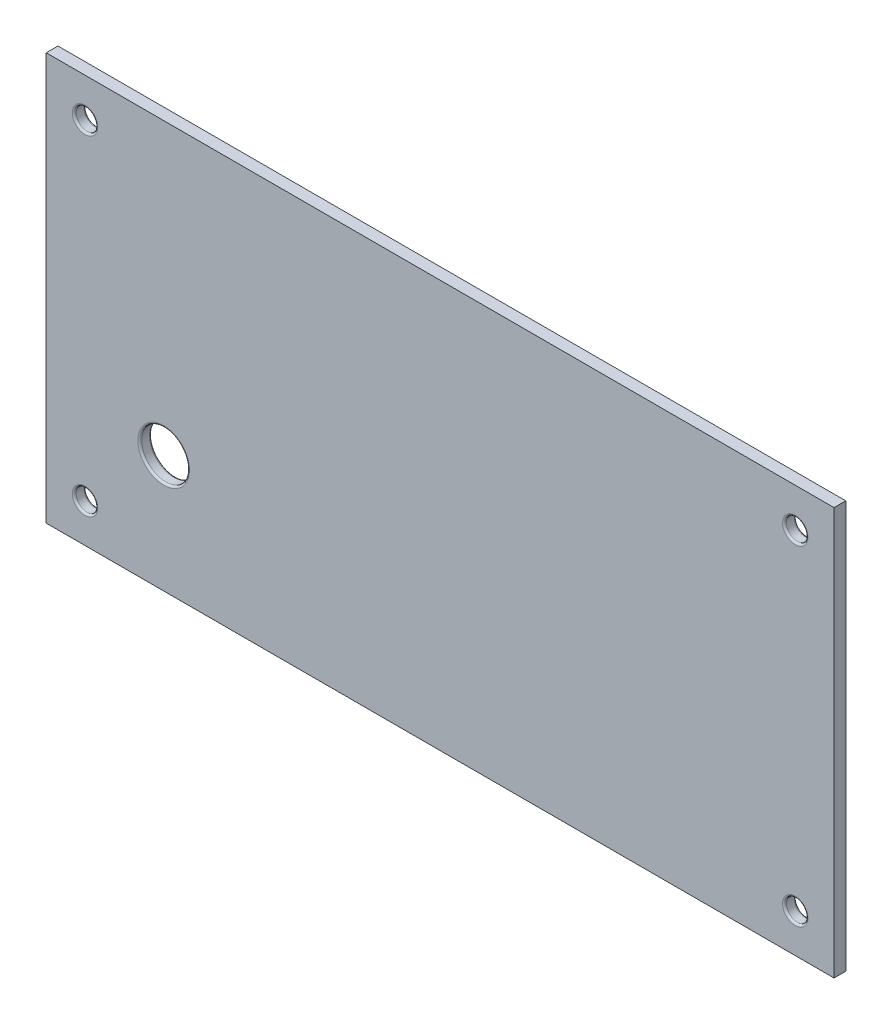
ISO-10303-21;
HEADER;
FILE_DESCRIPTION(('STEP AP214'),'2;1');
FILE_NAME('part.step','',(''),(''),'','','');
FILE_SCHEMA(('AUTOMOTIVE_DESIGN { 1 0 10303 214 1 1 1 1 }'));
ENDSEC;
DATA;
#1=APPLICATION_CONTEXT('core data for automotive mechanical design processes');
#2=APPLICATION_PROTOCOL_DEFINITION('international standard','automotive_design',2000,#1);
#3=PRODUCT_CONTEXT('',#1,'mechanical');
#4=PRODUCT('Part','Part','',(#3));
#5=PRODUCT_RELATED_PRODUCT_CATEGORY('part','',(#4));
#6=PRODUCT_DEFINITION_FORMATION('','',#4);
#7=PRODUCT_DEFINITION_CONTEXT('part definition',#1,'design');
#8=PRODUCT_DEFINITION('design','',#6,#7);
#9=PRODUCT_DEFINITION_SHAPE('','',#8);
#10=(LENGTH_UNIT() NAMED_UNIT(*) SI_UNIT(.MILLI.,.METRE.));
#11=(NAMED_UNIT(*) PLANE_ANGLE_UNIT() SI_UNIT($,.RADIAN.));
#12=(NAMED_UNIT(*) SI_UNIT($,.STERADIAN.) SOLID_ANGLE_UNIT());
#13=UNCERTAINTY_MEASURE_WITH_UNIT(LENGTH_MEASURE(1.E-05),#10,'distance_accuracy_value','');
#14=(GEOMETRIC_REPRESENTATION_CONTEXT(3) GLOBAL_UNCERTAINTY_ASSIGNED_CONTEXT((#13)) GLOBAL_UNIT_ASSIGNED_CONTEXT((#10,
#11,#12)) REPRESENTATION_CONTEXT('',''));
#15=CARTESIAN_POINT('',(0.,0.,0.));
#16=DIRECTION('',(0.,0.,1.));
#17=DIRECTION('',(1.,0.,0.));
#18=AXIS2_PLACEMENT_3D('',#15,#16,#17);
#19=CARTESIAN_POINT('',(100.602,-52.02,3.));
#20=DIRECTION('',(-1.,0.,0.));
#21=DIRECTION('',(0.,0.,1.));
#22=AXIS2_PLACEMENT_3D('',#19,#20,#21);
#23=PLANE('',#22);
#24=DIRECTION('',(0.,1.,0.));
#25=VECTOR('',#24,1.);
#26=CARTESIAN_POINT('',(100.602,-52.02,0.));
#27=LINE('',#26,#25);
#28=CARTESIAN_POINT('',(100.602,-52.02,0.));
#29=VERTEX_POINT('',#28);
#30=CARTESIAN_POINT('',(100.602,52.02,0.));
#31=VERTEX_POINT('',#30);
#32=EDGE_CURVE('E109',#29,#31,#27,.T.);
#33=ORIENTED_EDGE('',*,*,#32,.T.);
#34=DIRECTION('',(0.,0.,-1.));
#35=VECTOR('',#34,1.);
#36=CARTESIAN_POINT('',(100.602,52.02,3.));
#37=LINE('',#36,#35);
#38=CARTESIAN_POINT('',(100.602,52.02,3.));
#39=VERTEX_POINT('',#38);
#40=EDGE_CURVE('E100',#39,#31,#37,.T.);
#41=ORIENTED_EDGE('',*,*,#40,.F.);
#42=DIRECTION('',(0.,1.,0.));
#43=VECTOR('',#42,1.);
#44=CARTESIAN_POINT('',(100.602,-52.02,3.));
#45=LINE('',#44,#43);
#46=CARTESIAN_POINT('',(100.602,-52.02,3.));
#47=VERTEX_POINT('',#46);
#48=EDGE_CURVE('E94',#47,#39,#45,.T.);
#49=ORIENTED_EDGE('',*,*,#48,.F.);
#50=DIRECTION('',(0.,0.,-1.));
#51=VECTOR('',#50,1.);
#52=CARTESIAN_POINT('',(100.602,-52.02,3.));
#53=LINE('',#52,#51);
#54=EDGE_CURVE('E105',#47,#29,#53,.T.);
#55=ORIENTED_EDGE('',*,*,#54,.T.);
#56=EDGE_LOOP('',(#33,#41,#49,#55));
#57=FACE_BOUND('',#56,.T.);
#58=ADVANCED_FACE('F41',(#57),#23,.F.);
#59=CARTESIAN_POINT('',(-100.602,52.02,3.));
#60=DIRECTION('',(0.,-1.,0.));
#61=DIRECTION('',(0.,0.,-1.));
#62=AXIS2_PLACEMENT_3D('',#59,#60,#61);
#63=PLANE('',#62);
#64=DIRECTION('',(-1.,0.,0.));
#65=VECTOR('',#64,1.);
#66=CARTESIAN_POINT('',(-100.602,52.02,0.));
#67=LINE('',#66,#65);
#68=CARTESIAN_POINT('',(-100.602,52.02,0.));
#69=VERTEX_POINT('',#68);
#70=EDGE_CURVE('E99',#31,#69,#67,.T.);
#71=ORIENTED_EDGE('',*,*,#70,.T.);
#72=DIRECTION('',(0.,0.,-1.));
#73=VECTOR('',#72,1.);
#74=CARTESIAN_POINT('',(-100.602,52.02,3.));
#75=LINE('',#74,#73);
#76=CARTESIAN_POINT('',(-100.602,52.02,3.));
#77=VERTEX_POINT('',#76);
#78=EDGE_CURVE('E97',#77,#69,#75,.T.);
#79=ORIENTED_EDGE('',*,*,#78,.F.);
#80=DIRECTION('',(-1.,0.,0.));
#81=VECTOR('',#80,1.);
#82=CARTESIAN_POINT('',(-100.602,52.02,3.));
#83=LINE('',#82,#81);
#84=EDGE_CURVE('E89',#39,#77,#83,.T.);
#85=ORIENTED_EDGE('',*,*,#84,.F.);
#86=ORIENTED_EDGE('',*,*,#40,.T.);
#87=EDGE_LOOP('',(#71,#79,#85,#86));
#88=FACE_BOUND('',#87,.T.);
#89=ADVANCED_FACE('F98',(#88),#63,.F.);
#90=CARTESIAN_POINT('',(-100.602,-52.02,3.));
#91=DIRECTION('',(1.,0.,0.));
#92=DIRECTION('',(0.,0.,-1.));
#93=AXIS2_PLACEMENT_3D('',#90,#91,#92);
#94=PLANE('',#93);
#95=DIRECTION('',(0.,-1.,0.));
#96=VECTOR('',#95,1.);
#97=CARTESIAN_POINT('',(-100.602,-52.02,0.));
#98=LINE('',#97,#96);
#99=CARTESIAN_POINT('',(-100.602,-52.02,0.));
#100=VERTEX_POINT('',#99);
#101=EDGE_CURVE('E75',#69,#100,#98,.T.);
#102=ORIENTED_EDGE('',*,*,#101,.T.);
#103=DIRECTION('',(0.,0.,-1.));
#104=VECTOR('',#103,1.);
#105=CARTESIAN_POINT('',(-100.602,-52.02,3.));
#106=LINE('',#105,#104);
#107=CARTESIAN_POINT('',(-100.602,-52.02,3.));
#108=VERTEX_POINT('',#107);
#109=EDGE_CURVE('E101',#108,#100,#106,.T.);
#110=ORIENTED_EDGE('',*,*,#109,.F.);
#111=DIRECTION('',(0.,-1.,0.));
#112=VECTOR('',#111,1.);
#113=CARTESIAN_POINT('',(-100.602,-52.02,3.));
#114=LINE('',#113,#112);
#115=EDGE_CURVE('E92',#77,#108,#114,.T.);
#116=ORIENTED_EDGE('',*,*,#115,.F.);
#117=ORIENTED_EDGE('',*,*,#78,.T.);
#118=EDGE_LOOP('',(#102,#110,#116,#117));
#119=FACE_BOUND('',#118,.T.);
#120=ADVANCED_FACE('F103',(#119),#94,.F.);
#121=CARTESIAN_POINT('',(-100.602,-52.02,3.));
#122=DIRECTION('',(0.,1.,0.));
#123=DIRECTION('',(0.,0.,1.));
#124=AXIS2_PLACEMENT_3D('',#121,#122,#123);
#125=PLANE('',#124);
#126=DIRECTION('',(1.,0.,0.));
#127=VECTOR('',#126,1.);
#128=CARTESIAN_POINT('',(-100.602,-52.02,0.));
#129=LINE('',#128,#127);
#130=EDGE_CURVE('E81',#100,#29,#129,.T.);
#131=ORIENTED_EDGE('',*,*,#130,.T.);
#132=ORIENTED_EDGE('',*,*,#54,.F.);
#133=DIRECTION('',(1.,0.,0.));
#134=VECTOR('',#133,1.);
#135=CARTESIAN_POINT('',(-100.602,-52.02,3.));
#136=LINE('',#135,#134);
#137=EDGE_CURVE('E58',#108,#47,#136,.T.);
#138=ORIENTED_EDGE('',*,*,#137,.F.);
#139=ORIENTED_EDGE('',*,*,#109,.T.);
#140=EDGE_LOOP('',(#131,#132,#138,#139));
#141=FACE_BOUND('',#140,.T.);
#142=ADVANCED_FACE('F207',(#141),#125,.F.);
#143=CARTESIAN_POINT('',(0.,0.,3.));
#144=DIRECTION('',(0.,0.,-1.));
#145=DIRECTION('',(-1.,0.,0.));
#146=AXIS2_PLACEMENT_3D('',#143,#144,#145);
#147=PLANE('',#146);
#148=CARTESIAN_POINT('',(-70.602,-22.02,3.));
#149=DIRECTION('',(0.,0.,-1.));
#150=DIRECTION('',(-1.,0.,0.));
#151=AXIS2_PLACEMENT_3D('',#148,#149,#150);
#152=CIRCLE('',#151,6.59999999999999);
#153=CARTESIAN_POINT('',(-77.202,-22.02,3.));
#154=VERTEX_POINT('',#153);
#155=EDGE_CURVE('E50',#154,#154,#152,.T.);
#156=ORIENTED_EDGE('',*,*,#155,.T.);
#157=EDGE_LOOP('',(#156));
#158=FACE_BOUND('',#157,.T.);
#159=CARTESIAN_POINT('',(90.702,42.12,3.));
#160=DIRECTION('',(0.,0.,-1.));
#161=DIRECTION('',(-1.,0.,0.));
#162=AXIS2_PLACEMENT_3D('',#159,#160,#161);
#163=CIRCLE('',#162,3.25000000000001);
#164=CARTESIAN_POINT('',(87.452,42.12,3.));
#165=VERTEX_POINT('',#164);
#166=EDGE_CURVE('E133',#165,#165,#163,.T.);
#167=ORIENTED_EDGE('',*,*,#166,.T.);
#168=EDGE_LOOP('',(#167));
#169=FACE_BOUND('',#168,.T.);
#170=CARTESIAN_POINT('',(90.702,-42.12,3.));
#171=DIRECTION('',(0.,0.,-1.));
#172=DIRECTION('',(-1.,0.,0.));
#173=AXIS2_PLACEMENT_3D('',#170,#171,#172);
#174=CIRCLE('',#173,3.25000000000001);
#175=CARTESIAN_POINT('',(87.452,-42.12,3.));
#176=VERTEX_POINT('',#175);
#177=EDGE_CURVE('E130',#176,#176,#174,.T.);
#178=ORIENTED_EDGE('',*,*,#177,.T.);
#179=EDGE_LOOP('',(#178));
#180=FACE_BOUND('',#179,.T.);
#181=CARTESIAN_POINT('',(-90.702,-42.12,3.));
#182=DIRECTION('',(0.,0.,-1.));
#183=DIRECTION('',(-1.,0.,0.));
#184=AXIS2_PLACEMENT_3D('',#181,#182,#183);
#185=CIRCLE('',#184,3.25000000000001);
#186=CARTESIAN_POINT('',(-93.952,-42.12,3.));
#187=VERTEX_POINT('',#186);
#188=EDGE_CURVE('E127',#187,#187,#185,.T.);
#189=ORIENTED_EDGE('',*,*,#188,.T.);
#190=EDGE_LOOP('',(#189));
#191=FACE_BOUND('',#190,.T.);
#192=CARTESIAN_POINT('',(-90.702,42.12,3.));
#193=DIRECTION('',(0.,0.,-1.));
#194=DIRECTION('',(-1.,0.,0.));
#195=AXIS2_PLACEMENT_3D('',#192,#193,#194);
#196=CIRCLE('',#195,3.25000000000001);
#197=CARTESIAN_POINT('',(-93.952,42.12,3.));
#198=VERTEX_POINT('',#197);
#199=EDGE_CURVE('E124',#198,#198,#196,.T.);
#200=ORIENTED_EDGE('',*,*,#199,.T.);
#201=EDGE_LOOP('',(#200));
#202=FACE_BOUND('',#201,.T.);
#203=ORIENTED_EDGE('',*,*,#48,.T.);
#204=ORIENTED_EDGE('',*,*,#84,.T.);
#205=ORIENTED_EDGE('',*,*,#115,.T.);
#206=ORIENTED_EDGE('',*,*,#137,.T.);
#207=EDGE_LOOP('',(#203,#204,#205,#206));
#208=FACE_BOUND('',#207,.T.);
#209=ADVANCED_FACE('F90',(#158,#169,#180,#191,#202,#208),#147,.F.);
#210=CARTESIAN_POINT('',(0.,0.,0.));
#211=DIRECTION('',(0.,0.,-1.));
#212=DIRECTION('',(-1.,0.,0.));
#213=AXIS2_PLACEMENT_3D('',#210,#211,#212);
#214=PLANE('',#213);
#215=CARTESIAN_POINT('',(-70.602,-22.02,0.));
#216=DIRECTION('',(0.,0.,-1.));
#217=DIRECTION('',(-1.,0.,0.));
#218=AXIS2_PLACEMENT_3D('',#215,#216,#217);
#219=CIRCLE('',#218,6.59999999999999);
#220=CARTESIAN_POINT('',(-77.202,-22.02,0.));
#221=VERTEX_POINT('',#220);
#222=EDGE_CURVE('E11',#221,#221,#219,.F.);
#223=ORIENTED_EDGE('',*,*,#222,.T.);
#224=EDGE_LOOP('',(#223));
#225=FACE_BOUND('',#224,.T.);
#226=CARTESIAN_POINT('',(90.702,42.12,0.));
#227=DIRECTION('',(0.,0.,-1.));
#228=DIRECTION('',(-1.,0.,0.));
#229=AXIS2_PLACEMENT_3D('',#226,#227,#228);
#230=CIRCLE('',#229,3.25000000000001);
#231=CARTESIAN_POINT('',(87.452,42.12,0.));
#232=VERTEX_POINT('',#231);
#233=EDGE_CURVE('E145',#232,#232,#230,.F.);
#234=ORIENTED_EDGE('',*,*,#233,.T.);
#235=EDGE_LOOP('',(#234));
#236=FACE_BOUND('',#235,.T.);
#237=CARTESIAN_POINT('',(90.702,-42.12,0.));
#238=DIRECTION('',(0.,0.,-1.));
#239=DIRECTION('',(-1.,0.,0.));
#240=AXIS2_PLACEMENT_3D('',#237,#238,#239);
#241=CIRCLE('',#240,3.25000000000001);
#242=CARTESIAN_POINT('',(87.452,-42.12,0.));
#243=VERTEX_POINT('',#242);
#244=EDGE_CURVE('E142',#243,#243,#241,.F.);
#245=ORIENTED_EDGE('',*,*,#244,.T.);
#246=EDGE_LOOP('',(#245));
#247=FACE_BOUND('',#246,.T.);
#248=CARTESIAN_POINT('',(-90.702,-42.12,0.));
#249=DIRECTION('',(0.,0.,-1.));
#250=DIRECTION('',(-1.,0.,0.));
#251=AXIS2_PLACEMENT_3D('',#248,#249,#250);
#252=CIRCLE('',#251,3.25000000000001);
#253=CARTESIAN_POINT('',(-93.952,-42.12,0.));
#254=VERTEX_POINT('',#253);
#255=EDGE_CURVE('E139',#254,#254,#252,.F.);
#256=ORIENTED_EDGE('',*,*,#255,.T.);
#257=EDGE_LOOP('',(#256));
#258=FACE_BOUND('',#257,.T.);
#259=CARTESIAN_POINT('',(-90.702,42.12,0.));
#260=DIRECTION('',(0.,0.,-1.));
#261=DIRECTION('',(-1.,0.,0.));
#262=AXIS2_PLACEMENT_3D('',#259,#260,#261);
#263=CIRCLE('',#262,3.25000000000001);
#264=CARTESIAN_POINT('',(-93.952,42.12,0.));
#265=VERTEX_POINT('',#264);
#266=EDGE_CURVE('E136',#265,#265,#263,.F.);
#267=ORIENTED_EDGE('',*,*,#266,.T.);
#268=EDGE_LOOP('',(#267));
#269=FACE_BOUND('',#268,.T.);
#270=ORIENTED_EDGE('',*,*,#32,.F.);
#271=ORIENTED_EDGE('',*,*,#130,.F.);
#272=ORIENTED_EDGE('',*,*,#101,.F.);
#273=ORIENTED_EDGE('',*,*,#70,.F.);
#274=EDGE_LOOP('',(#270,#271,#272,#273));
#275=FACE_BOUND('',#274,.T.);
#276=ADVANCED_FACE('F192',(#225,#236,#247,#258,#269,#275),#214,.T.);
#277=CARTESIAN_POINT('',(-90.702,42.12,0.));
#278=DIRECTION('',(0.,0.,1.));
#279=DIRECTION('',(1.,0.,0.));
#280=AXIS2_PLACEMENT_3D('',#277,#278,#279);
#281=CYLINDRICAL_SURFACE('',#280,2.75000000000001);
#282=CARTESIAN_POINT('',(-90.702,42.12,2.5));
#283=DIRECTION('',(0.,0.,-1.));
#284=DIRECTION('',(-1.,0.,0.));
#285=AXIS2_PLACEMENT_3D('',#282,#283,#284);
#286=CIRCLE('',#285,2.75000000000001);
#287=CARTESIAN_POINT('',(-93.452,42.12,2.5));
#288=VERTEX_POINT('',#287);
#289=EDGE_CURVE('E163',#288,#288,#286,.F.);
#290=ORIENTED_EDGE('',*,*,#289,.T.);
#291=EDGE_LOOP('',(#290));
#292=FACE_BOUND('',#291,.T.);
#293=CARTESIAN_POINT('',(-90.702,42.12,0.5));
#294=DIRECTION('',(0.,0.,-1.));
#295=DIRECTION('',(-1.,0.,0.));
#296=AXIS2_PLACEMENT_3D('',#293,#294,#295);
#297=CIRCLE('',#296,2.75000000000001);
#298=CARTESIAN_POINT('',(-93.452,42.12,0.5));
#299=VERTEX_POINT('',#298);
#300=EDGE_CURVE('E160',#299,#299,#297,.T.);
#301=ORIENTED_EDGE('',*,*,#300,.T.);
#302=EDGE_LOOP('',(#301));
#303=FACE_BOUND('',#302,.T.);
#304=ADVANCED_FACE('F195',(#292,#303),#281,.F.);
#305=CARTESIAN_POINT('',(90.702,42.12,0.));
#306=DIRECTION('',(0.,0.,1.));
#307=DIRECTION('',(1.,0.,0.));
#308=AXIS2_PLACEMENT_3D('',#305,#306,#307);
#309=CYLINDRICAL_SURFACE('',#308,2.75000000000001);
#310=CARTESIAN_POINT('',(90.702,42.12,2.5));
#311=DIRECTION('',(0.,0.,-1.));
#312=DIRECTION('',(-1.,0.,0.));
#313=AXIS2_PLACEMENT_3D('',#310,#311,#312);
#314=CIRCLE('',#313,2.75000000000001);
#315=CARTESIAN_POINT('',(87.952,42.12,2.5));
#316=VERTEX_POINT('',#315);
#317=EDGE_CURVE('E121',#316,#316,#314,.F.);
#318=ORIENTED_EDGE('',*,*,#317,.T.);
#319=EDGE_LOOP('',(#318));
#320=FACE_BOUND('',#319,.T.);
#321=CARTESIAN_POINT('',(90.702,42.12,0.5));
#322=DIRECTION('',(0.,0.,-1.));
#323=DIRECTION('',(-1.,0.,0.));
#324=AXIS2_PLACEMENT_3D('',#321,#322,#323);
#325=CIRCLE('',#324,2.75000000000001);
#326=CARTESIAN_POINT('',(87.952,42.12,0.5));
#327=VERTEX_POINT('',#326);
#328=EDGE_CURVE('E118',#327,#327,#325,.T.);
#329=ORIENTED_EDGE('',*,*,#328,.T.);
#330=EDGE_LOOP('',(#329));
#331=FACE_BOUND('',#330,.T.);
#332=ADVANCED_FACE('F260',(#320,#331),#309,.F.);
#333=CARTESIAN_POINT('',(90.702,-42.12,0.));
#334=DIRECTION('',(0.,0.,1.));
#335=DIRECTION('',(1.,0.,0.));
#336=AXIS2_PLACEMENT_3D('',#333,#334,#335);
#337=CYLINDRICAL_SURFACE('',#336,2.75000000000001);
#338=CARTESIAN_POINT('',(90.702,-42.12,2.5));
#339=DIRECTION('',(0.,0.,-1.));
#340=DIRECTION('',(-1.,0.,0.));
#341=AXIS2_PLACEMENT_3D('',#338,#339,#340);
#342=CIRCLE('',#341,2.75000000000001);
#343=CARTESIAN_POINT('',(87.952,-42.12,2.5));
#344=VERTEX_POINT('',#343);
#345=EDGE_CURVE('E151',#344,#344,#342,.F.);
#346=ORIENTED_EDGE('',*,*,#345,.T.);
#347=EDGE_LOOP('',(#346));
#348=FACE_BOUND('',#347,.T.);
#349=CARTESIAN_POINT('',(90.702,-42.12,0.5));
#350=DIRECTION('',(0.,0.,-1.));
#351=DIRECTION('',(-1.,0.,0.));
#352=AXIS2_PLACEMENT_3D('',#349,#350,#351);
#353=CIRCLE('',#352,2.75000000000001);
#354=CARTESIAN_POINT('',(87.952,-42.12,0.5));
#355=VERTEX_POINT('',#354);
#356=EDGE_CURVE('E148',#355,#355,#353,.T.);
#357=ORIENTED_EDGE('',*,*,#356,.T.);
#358=EDGE_LOOP('',(#357));
#359=FACE_BOUND('',#358,.T.);
#360=ADVANCED_FACE('F266',(#348,#359),#337,.F.);
#361=CARTESIAN_POINT('',(-90.702,-42.12,0.));
#362=DIRECTION('',(0.,0.,1.));
#363=DIRECTION('',(1.,0.,0.));
#364=AXIS2_PLACEMENT_3D('',#361,#362,#363);
#365=CYLINDRICAL_SURFACE('',#364,2.75000000000001);
#366=CARTESIAN_POINT('',(-90.702,-42.12,2.5));
#367=DIRECTION('',(0.,0.,-1.));
#368=DIRECTION('',(-1.,0.,0.));
#369=AXIS2_PLACEMENT_3D('',#366,#367,#368);
#370=CIRCLE('',#369,2.75000000000001);
#371=CARTESIAN_POINT('',(-93.452,-42.12,2.5));
#372=VERTEX_POINT('',#371);
#373=EDGE_CURVE('E157',#372,#372,#370,.F.);
#374=ORIENTED_EDGE('',*,*,#373,.T.);
#375=EDGE_LOOP('',(#374));
#376=FACE_BOUND('',#375,.T.);
#377=CARTESIAN_POINT('',(-90.702,-42.12,0.5));
#378=DIRECTION('',(0.,0.,-1.));
#379=DIRECTION('',(-1.,0.,0.));
#380=AXIS2_PLACEMENT_3D('',#377,#378,#379);
#381=CIRCLE('',#380,2.75000000000001);
#382=CARTESIAN_POINT('',(-93.452,-42.12,0.5));
#383=VERTEX_POINT('',#382);
#384=EDGE_CURVE('E154',#383,#383,#381,.T.);
#385=ORIENTED_EDGE('',*,*,#384,.T.);
#386=EDGE_LOOP('',(#385));
#387=FACE_BOUND('',#386,.T.);
#388=ADVANCED_FACE('F228',(#376,#387),#365,.F.);
#389=CARTESIAN_POINT('',(90.702,42.12,2.5));
#390=DIRECTION('',(0.,0.,-1.));
#391=DIRECTION('',(-1.,0.,0.));
#392=AXIS2_PLACEMENT_3D('',#389,#390,#391);
#393=TOROIDAL_SURFACE('',#392,3.25000000000001,0.5);
#394=ORIENTED_EDGE('',*,*,#166,.F.);
#395=EDGE_LOOP('',(#394));
#396=FACE_BOUND('',#395,.T.);
#397=ORIENTED_EDGE('',*,*,#317,.F.);
#398=EDGE_LOOP('',(#397));
#399=FACE_BOUND('',#398,.T.);
#400=ADVANCED_FACE('F224',(#396,#399),#393,.T.);
#401=CARTESIAN_POINT('',(90.702,42.12,0.5));
#402=DIRECTION('',(0.,0.,-1.));
#403=DIRECTION('',(-1.,0.,0.));
#404=AXIS2_PLACEMENT_3D('',#401,#402,#403);
#405=TOROIDAL_SURFACE('',#404,3.25000000000001,0.5);
#406=ORIENTED_EDGE('',*,*,#328,.F.);
#407=EDGE_LOOP('',(#406));
#408=FACE_BOUND('',#407,.T.);
#409=ORIENTED_EDGE('',*,*,#233,.F.);
#410=EDGE_LOOP('',(#409));
#411=FACE_BOUND('',#410,.T.);
#412=ADVANCED_FACE('F227',(#408,#411),#405,.T.);
#413=CARTESIAN_POINT('',(90.702,-42.12,2.5));
#414=DIRECTION('',(0.,0.,-1.));
#415=DIRECTION('',(-1.,0.,0.));
#416=AXIS2_PLACEMENT_3D('',#413,#414,#415);
#417=TOROIDAL_SURFACE('',#416,3.25000000000001,0.5);
#418=ORIENTED_EDGE('',*,*,#177,.F.);
#419=EDGE_LOOP('',(#418));
#420=FACE_BOUND('',#419,.T.);
#421=ORIENTED_EDGE('',*,*,#345,.F.);
#422=EDGE_LOOP('',(#421));
#423=FACE_BOUND('',#422,.T.);
#424=ADVANCED_FACE('F232',(#420,#423),#417,.T.);
#425=CARTESIAN_POINT('',(90.702,-42.12,0.5));
#426=DIRECTION('',(0.,0.,-1.));
#427=DIRECTION('',(-1.,0.,0.));
#428=AXIS2_PLACEMENT_3D('',#425,#426,#427);
#429=TOROIDAL_SURFACE('',#428,3.25000000000001,0.5);
#430=ORIENTED_EDGE('',*,*,#356,.F.);
#431=EDGE_LOOP('',(#430));
#432=FACE_BOUND('',#431,.T.);
#433=ORIENTED_EDGE('',*,*,#244,.F.);
#434=EDGE_LOOP('',(#433));
#435=FACE_BOUND('',#434,.T.);
#436=ADVANCED_FACE('F236',(#432,#435),#429,.T.);
#437=CARTESIAN_POINT('',(-90.702,-42.12,2.5));
#438=DIRECTION('',(0.,0.,-1.));
#439=DIRECTION('',(-1.,0.,0.));
#440=AXIS2_PLACEMENT_3D('',#437,#438,#439);
#441=TOROIDAL_SURFACE('',#440,3.25000000000001,0.5);
#442=ORIENTED_EDGE('',*,*,#188,.F.);
#443=EDGE_LOOP('',(#442));
#444=FACE_BOUND('',#443,.T.);
#445=ORIENTED_EDGE('',*,*,#373,.F.);
#446=EDGE_LOOP('',(#445));
#447=FACE_BOUND('',#446,.T.);
#448=ADVANCED_FACE('F240',(#444,#447),#441,.T.);
#449=CARTESIAN_POINT('',(-90.702,-42.12,0.5));
#450=DIRECTION('',(0.,0.,-1.));
#451=DIRECTION('',(-1.,0.,0.));
#452=AXIS2_PLACEMENT_3D('',#449,#450,#451);
#453=TOROIDAL_SURFACE('',#452,3.25000000000001,0.5);
#454=ORIENTED_EDGE('',*,*,#384,.F.);
#455=EDGE_LOOP('',(#454));
#456=FACE_BOUND('',#455,.T.);
#457=ORIENTED_EDGE('',*,*,#255,.F.);
#458=EDGE_LOOP('',(#457));
#459=FACE_BOUND('',#458,.T.);
#460=ADVANCED_FACE('F244',(#456,#459),#453,.T.);
#461=CARTESIAN_POINT('',(-90.702,42.12,2.5));
#462=DIRECTION('',(0.,0.,-1.));
#463=DIRECTION('',(-1.,0.,0.));
#464=AXIS2_PLACEMENT_3D('',#461,#462,#463);
#465=TOROIDAL_SURFACE('',#464,3.25000000000001,0.5);
#466=ORIENTED_EDGE('',*,*,#199,.F.);
#467=EDGE_LOOP('',(#466));
#468=FACE_BOUND('',#467,.T.);
#469=ORIENTED_EDGE('',*,*,#289,.F.);
#470=EDGE_LOOP('',(#469));
#471=FACE_BOUND('',#470,.T.);
#472=ADVANCED_FACE('F248',(#468,#471),#465,.T.);
#473=CARTESIAN_POINT('',(-90.702,42.12,0.5));
#474=DIRECTION('',(0.,0.,-1.));
#475=DIRECTION('',(-1.,0.,0.));
#476=AXIS2_PLACEMENT_3D('',#473,#474,#475);
#477=TOROIDAL_SURFACE('',#476,3.25000000000001,0.5);
#478=ORIENTED_EDGE('',*,*,#300,.F.);
#479=EDGE_LOOP('',(#478));
#480=FACE_BOUND('',#479,.T.);
#481=ORIENTED_EDGE('',*,*,#266,.F.);
#482=EDGE_LOOP('',(#481));
#483=FACE_BOUND('',#482,.T.);
#484=ADVANCED_FACE('F184',(#480,#483),#477,.T.);
#485=CARTESIAN_POINT('',(-70.602,-22.02,0.));
#486=DIRECTION('',(0.,0.,1.));
#487=DIRECTION('',(1.,0.,0.));
#488=AXIS2_PLACEMENT_3D('',#485,#486,#487);
#489=CYLINDRICAL_SURFACE('',#488,6.1);
#490=CARTESIAN_POINT('',(-70.602,-22.02,2.5));
#491=DIRECTION('',(0.,0.,-1.));
#492=DIRECTION('',(-1.,0.,0.));
#493=AXIS2_PLACEMENT_3D('',#490,#491,#492);
#494=CIRCLE('',#493,6.1);
#495=CARTESIAN_POINT('',(-76.702,-22.02,2.5));
#496=VERTEX_POINT('',#495);
#497=EDGE_CURVE('E169',#496,#496,#494,.F.);
#498=ORIENTED_EDGE('',*,*,#497,.T.);
#499=EDGE_LOOP('',(#498));
#500=FACE_BOUND('',#499,.T.);
#501=CARTESIAN_POINT('',(-70.602,-22.02,0.5));
#502=DIRECTION('',(0.,0.,-1.));
#503=DIRECTION('',(-1.,0.,0.));
#504=AXIS2_PLACEMENT_3D('',#501,#502,#503);
#505=CIRCLE('',#504,6.1);
#506=CARTESIAN_POINT('',(-76.702,-22.02,0.5));
#507=VERTEX_POINT('',#506);
#508=EDGE_CURVE('E166',#507,#507,#505,.T.);
#509=ORIENTED_EDGE('',*,*,#508,.T.);
#510=EDGE_LOOP('',(#509));
#511=FACE_BOUND('',#510,.T.);
#512=ADVANCED_FACE('F179',(#500,#511),#489,.F.);
#513=CARTESIAN_POINT('',(-70.602,-22.02,2.5));
#514=DIRECTION('',(0.,0.,-1.));
#515=DIRECTION('',(-1.,0.,0.));
#516=AXIS2_PLACEMENT_3D('',#513,#514,#515);
#517=TOROIDAL_SURFACE('',#516,6.59999999999999,0.5);
#518=ORIENTED_EDGE('',*,*,#155,.F.);
#519=EDGE_LOOP('',(#518));
#520=FACE_BOUND('',#519,.T.);
#521=ORIENTED_EDGE('',*,*,#497,.F.);
#522=EDGE_LOOP('',(#521));
#523=FACE_BOUND('',#522,.T.);
#524=ADVANCED_FACE('F176',(#520,#523),#517,.T.);
#525=CARTESIAN_POINT('',(-70.602,-22.02,0.5));
#526=DIRECTION('',(0.,0.,-1.));
#527=DIRECTION('',(-1.,0.,0.));
#528=AXIS2_PLACEMENT_3D('',#525,#526,#527);
#529=TOROIDAL_SURFACE('',#528,6.59999999999999,0.5);
#530=ORIENTED_EDGE('',*,*,#508,.F.);
#531=EDGE_LOOP('',(#530));
#532=FACE_BOUND('',#531,.T.);
#533=ORIENTED_EDGE('',*,*,#222,.F.);
#534=EDGE_LOOP('',(#533));
#535=FACE_BOUND('',#534,.T.);
#536=ADVANCED_FACE('F43',(#532,#535),#529,.T.);
#537=CLOSED_SHELL('',(#58,#89,#120,#142,#209,#276,#304,#332,#360,#388,#400,#412,#424,#436,#448,
#460,#472,#484,#512,#524,#536));
#538=MANIFOLD_SOLID_BREP('B2',#537);
#539=ADVANCED_BREP_SHAPE_REPRESENTATION('',(#18,#538),#14);
#540=SHAPE_DEFINITION_REPRESENTATION(#9,#539);
ENDSEC;
END-ISO-10303-21;
